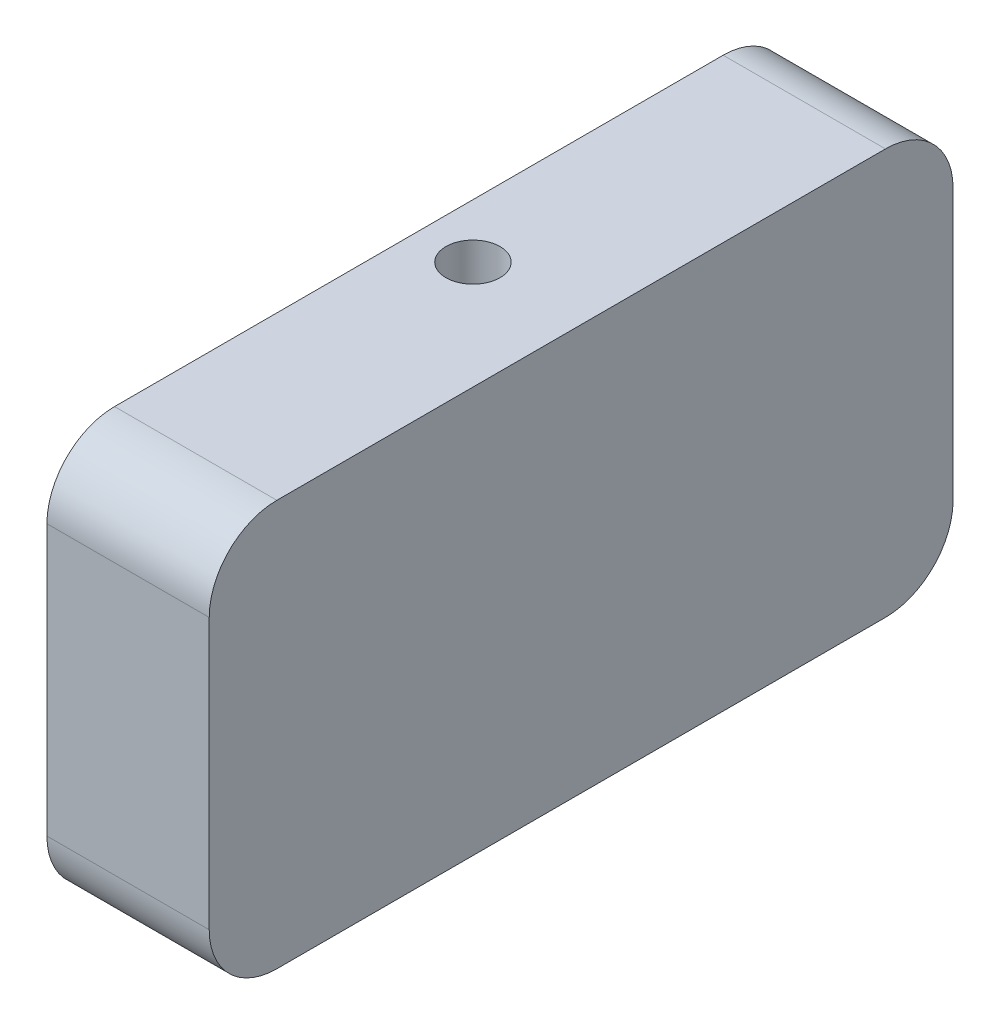
ISO-10303-21;
HEADER;
FILE_DESCRIPTION(('STEP AP214'),'2;1');
FILE_NAME('part.step','',(''),(''),'','','');
FILE_SCHEMA(('AUTOMOTIVE_DESIGN { 1 0 10303 214 1 1 1 1 }'));
ENDSEC;
DATA;
#1=APPLICATION_CONTEXT('core data for automotive mechanical design processes');
#2=APPLICATION_PROTOCOL_DEFINITION('international standard','automotive_design',2000,#1);
#3=PRODUCT_CONTEXT('',#1,'mechanical');
#4=PRODUCT('Part','Part','',(#3));
#5=PRODUCT_RELATED_PRODUCT_CATEGORY('part','',(#4));
#6=PRODUCT_DEFINITION_FORMATION('','',#4);
#7=PRODUCT_DEFINITION_CONTEXT('part definition',#1,'design');
#8=PRODUCT_DEFINITION('design','',#6,#7);
#9=PRODUCT_DEFINITION_SHAPE('','',#8);
#10=(LENGTH_UNIT() NAMED_UNIT(*) SI_UNIT(.MILLI.,.METRE.));
#11=(NAMED_UNIT(*) PLANE_ANGLE_UNIT() SI_UNIT($,.RADIAN.));
#12=(NAMED_UNIT(*) SI_UNIT($,.STERADIAN.) SOLID_ANGLE_UNIT());
#13=UNCERTAINTY_MEASURE_WITH_UNIT(LENGTH_MEASURE(1.E-05),#10,'distance_accuracy_value','');
#14=(GEOMETRIC_REPRESENTATION_CONTEXT(3) GLOBAL_UNCERTAINTY_ASSIGNED_CONTEXT((#13)) GLOBAL_UNIT_ASSIGNED_CONTEXT((#10,
#11,#12)) REPRESENTATION_CONTEXT('',''));
#15=CARTESIAN_POINT('',(0.,0.,0.));
#16=DIRECTION('',(0.,0.,1.));
#17=DIRECTION('',(1.,0.,0.));
#18=AXIS2_PLACEMENT_3D('',#15,#16,#17);
#19=CARTESIAN_POINT('',(12.,10.,-22.5));
#20=DIRECTION('',(-1.,0.,0.));
#21=DIRECTION('',(0.,0.,1.));
#22=AXIS2_PLACEMENT_3D('',#19,#20,#21);
#23=CYLINDRICAL_SURFACE('',#22,5.);
#24=CARTESIAN_POINT('',(0.,10.,-22.5));
#25=DIRECTION('',(1.,0.,0.));
#26=DIRECTION('',(0.,0.,1.));
#27=AXIS2_PLACEMENT_3D('',#24,#25,#26);
#28=CIRCLE('',#27,5.);
#29=CARTESIAN_POINT('',(0.,9.99999999999996,-27.5));
#30=VERTEX_POINT('',#29);
#31=CARTESIAN_POINT('',(0.,15.,-22.5));
#32=VERTEX_POINT('',#31);
#33=EDGE_CURVE('E138',#30,#32,#28,.T.);
#34=ORIENTED_EDGE('',*,*,#33,.T.);
#35=DIRECTION('',(-1.,0.,0.));
#36=VECTOR('',#35,1.);
#37=CARTESIAN_POINT('',(12.,15.,-22.5));
#38=LINE('',#37,#36);
#39=CARTESIAN_POINT('',(12.,15.,-22.5));
#40=VERTEX_POINT('',#39);
#41=EDGE_CURVE('E11',#40,#32,#38,.T.);
#42=ORIENTED_EDGE('',*,*,#41,.F.);
#43=CARTESIAN_POINT('',(12.,10.,-22.5));
#44=DIRECTION('',(1.,0.,0.));
#45=DIRECTION('',(0.,0.,1.));
#46=AXIS2_PLACEMENT_3D('',#43,#44,#45);
#47=CIRCLE('',#46,5.);
#48=CARTESIAN_POINT('',(12.,9.99999999999996,-27.5));
#49=VERTEX_POINT('',#48);
#50=EDGE_CURVE('E153',#49,#40,#47,.T.);
#51=ORIENTED_EDGE('',*,*,#50,.F.);
#52=DIRECTION('',(-1.,0.,0.));
#53=VECTOR('',#52,1.);
#54=CARTESIAN_POINT('',(12.,9.99999999999996,-27.5));
#55=LINE('',#54,#53);
#56=EDGE_CURVE('E134',#49,#30,#55,.T.);
#57=ORIENTED_EDGE('',*,*,#56,.T.);
#58=EDGE_LOOP('',(#34,#42,#51,#57));
#59=FACE_BOUND('',#58,.T.);
#60=ADVANCED_FACE('F36',(#59),#23,.T.);
#61=CARTESIAN_POINT('',(12.,15.,22.5));
#62=DIRECTION('',(0.,-1.,0.));
#63=DIRECTION('',(0.,0.,-1.));
#64=AXIS2_PLACEMENT_3D('',#61,#62,#63);
#65=PLANE('',#64);
#66=CARTESIAN_POINT('',(4.,15.,0.));
#67=DIRECTION('',(0.,-1.,0.));
#68=DIRECTION('',(0.,0.,-1.));
#69=AXIS2_PLACEMENT_3D('',#66,#67,#68);
#70=CIRCLE('',#69,2.);
#71=CARTESIAN_POINT('',(4.,15.,-2.));
#72=VERTEX_POINT('',#71);
#73=EDGE_CURVE('E218',#72,#72,#70,.T.);
#74=ORIENTED_EDGE('',*,*,#73,.T.);
#75=EDGE_LOOP('',(#74));
#76=FACE_BOUND('',#75,.T.);
#77=DIRECTION('',(0.,0.,1.));
#78=VECTOR('',#77,1.);
#79=CARTESIAN_POINT('',(0.,15.,22.5));
#80=LINE('',#79,#78);
#81=CARTESIAN_POINT('',(0.,15.,22.5));
#82=VERTEX_POINT('',#81);
#83=EDGE_CURVE('E141',#32,#82,#80,.T.);
#84=ORIENTED_EDGE('',*,*,#83,.T.);
#85=DIRECTION('',(-1.,0.,0.));
#86=VECTOR('',#85,1.);
#87=CARTESIAN_POINT('',(12.,15.,22.5));
#88=LINE('',#87,#86);
#89=CARTESIAN_POINT('',(12.,15.,22.5));
#90=VERTEX_POINT('',#89);
#91=EDGE_CURVE('E49',#90,#82,#88,.T.);
#92=ORIENTED_EDGE('',*,*,#91,.F.);
#93=DIRECTION('',(0.,0.,1.));
#94=VECTOR('',#93,1.);
#95=CARTESIAN_POINT('',(12.,15.,22.5));
#96=LINE('',#95,#94);
#97=EDGE_CURVE('E101',#40,#90,#96,.T.);
#98=ORIENTED_EDGE('',*,*,#97,.F.);
#99=ORIENTED_EDGE('',*,*,#41,.T.);
#100=EDGE_LOOP('',(#84,#92,#98,#99));
#101=FACE_BOUND('',#100,.T.);
#102=ADVANCED_FACE('F191',(#76,#101),#65,.F.);
#103=CARTESIAN_POINT('',(12.,10.,22.5));
#104=DIRECTION('',(-1.,0.,0.));
#105=DIRECTION('',(0.,0.,1.));
#106=AXIS2_PLACEMENT_3D('',#103,#104,#105);
#107=CYLINDRICAL_SURFACE('',#106,5.);
#108=CARTESIAN_POINT('',(0.,10.,22.5));
#109=DIRECTION('',(1.,0.,0.));
#110=DIRECTION('',(0.,0.,1.));
#111=AXIS2_PLACEMENT_3D('',#108,#109,#110);
#112=CIRCLE('',#111,5.);
#113=CARTESIAN_POINT('',(0.,9.99999999999996,27.5));
#114=VERTEX_POINT('',#113);
#115=EDGE_CURVE('E144',#82,#114,#112,.T.);
#116=ORIENTED_EDGE('',*,*,#115,.T.);
#117=DIRECTION('',(-1.,0.,0.));
#118=VECTOR('',#117,1.);
#119=CARTESIAN_POINT('',(12.,9.99999999999996,27.5));
#120=LINE('',#119,#118);
#121=CARTESIAN_POINT('',(12.,9.99999999999996,27.5));
#122=VERTEX_POINT('',#121);
#123=EDGE_CURVE('E160',#122,#114,#120,.T.);
#124=ORIENTED_EDGE('',*,*,#123,.F.);
#125=CARTESIAN_POINT('',(12.,10.,22.5));
#126=DIRECTION('',(1.,0.,0.));
#127=DIRECTION('',(0.,0.,1.));
#128=AXIS2_PLACEMENT_3D('',#125,#126,#127);
#129=CIRCLE('',#128,5.);
#130=EDGE_CURVE('E207',#90,#122,#129,.T.);
#131=ORIENTED_EDGE('',*,*,#130,.F.);
#132=ORIENTED_EDGE('',*,*,#91,.T.);
#133=EDGE_LOOP('',(#116,#124,#131,#132));
#134=FACE_BOUND('',#133,.T.);
#135=ADVANCED_FACE('F196',(#134),#107,.T.);
#136=CARTESIAN_POINT('',(12.,9.99999999999996,27.5));
#137=DIRECTION('',(0.,0.,-1.));
#138=DIRECTION('',(0.,1.,0.));
#139=AXIS2_PLACEMENT_3D('',#136,#137,#138);
#140=PLANE('',#139);
#141=DIRECTION('',(0.,-1.,0.));
#142=VECTOR('',#141,1.);
#143=CARTESIAN_POINT('',(0.,9.99999999999996,27.5));
#144=LINE('',#143,#142);
#145=CARTESIAN_POINT('',(0.,-9.99999999999997,27.5));
#146=VERTEX_POINT('',#145);
#147=EDGE_CURVE('E146',#114,#146,#144,.T.);
#148=ORIENTED_EDGE('',*,*,#147,.T.);
#149=DIRECTION('',(-1.,0.,0.));
#150=VECTOR('',#149,1.);
#151=CARTESIAN_POINT('',(12.,-9.99999999999997,27.5));
#152=LINE('',#151,#150);
#153=CARTESIAN_POINT('',(12.,-9.99999999999997,27.5));
#154=VERTEX_POINT('',#153);
#155=EDGE_CURVE('E157',#154,#146,#152,.T.);
#156=ORIENTED_EDGE('',*,*,#155,.F.);
#157=DIRECTION('',(0.,-1.,0.));
#158=VECTOR('',#157,1.);
#159=CARTESIAN_POINT('',(12.,9.99999999999996,27.5));
#160=LINE('',#159,#158);
#161=EDGE_CURVE('E209',#122,#154,#160,.T.);
#162=ORIENTED_EDGE('',*,*,#161,.F.);
#163=ORIENTED_EDGE('',*,*,#123,.T.);
#164=EDGE_LOOP('',(#148,#156,#162,#163));
#165=FACE_BOUND('',#164,.T.);
#166=ADVANCED_FACE('F235',(#165),#140,.F.);
#167=CARTESIAN_POINT('',(12.,-10.,22.5));
#168=DIRECTION('',(-1.,0.,0.));
#169=DIRECTION('',(0.,0.,1.));
#170=AXIS2_PLACEMENT_3D('',#167,#168,#169);
#171=CYLINDRICAL_SURFACE('',#170,5.);
#172=CARTESIAN_POINT('',(0.,-10.,22.5));
#173=DIRECTION('',(1.,0.,0.));
#174=DIRECTION('',(0.,0.,1.));
#175=AXIS2_PLACEMENT_3D('',#172,#173,#174);
#176=CIRCLE('',#175,5.);
#177=CARTESIAN_POINT('',(0.,-15.,22.5));
#178=VERTEX_POINT('',#177);
#179=EDGE_CURVE('E148',#146,#178,#176,.T.);
#180=ORIENTED_EDGE('',*,*,#179,.T.);
#181=DIRECTION('',(-1.,0.,0.));
#182=VECTOR('',#181,1.);
#183=CARTESIAN_POINT('',(12.,-15.,22.5));
#184=LINE('',#183,#182);
#185=CARTESIAN_POINT('',(12.,-15.,22.5));
#186=VERTEX_POINT('',#185);
#187=EDGE_CURVE('E129',#186,#178,#184,.T.);
#188=ORIENTED_EDGE('',*,*,#187,.F.);
#189=CARTESIAN_POINT('',(12.,-10.,22.5));
#190=DIRECTION('',(1.,0.,0.));
#191=DIRECTION('',(0.,0.,1.));
#192=AXIS2_PLACEMENT_3D('',#189,#190,#191);
#193=CIRCLE('',#192,5.);
#194=EDGE_CURVE('E120',#154,#186,#193,.T.);
#195=ORIENTED_EDGE('',*,*,#194,.F.);
#196=ORIENTED_EDGE('',*,*,#155,.T.);
#197=EDGE_LOOP('',(#180,#188,#195,#196));
#198=FACE_BOUND('',#197,.T.);
#199=ADVANCED_FACE('F227',(#198),#171,.T.);
#200=CARTESIAN_POINT('',(12.,-15.,22.5));
#201=DIRECTION('',(0.,1.,0.));
#202=DIRECTION('',(0.,0.,1.));
#203=AXIS2_PLACEMENT_3D('',#200,#201,#202);
#204=PLANE('',#203);
#205=CARTESIAN_POINT('',(4.,-15.,0.));
#206=DIRECTION('',(0.,-1.,0.));
#207=DIRECTION('',(0.,0.,-1.));
#208=AXIS2_PLACEMENT_3D('',#205,#206,#207);
#209=CIRCLE('',#208,2.);
#210=CARTESIAN_POINT('',(4.,-15.,-2.));
#211=VERTEX_POINT('',#210);
#212=EDGE_CURVE('E168',#211,#211,#209,.T.);
#213=ORIENTED_EDGE('',*,*,#212,.F.);
#214=EDGE_LOOP('',(#213));
#215=FACE_BOUND('',#214,.T.);
#216=DIRECTION('',(0.,0.,-1.));
#217=VECTOR('',#216,1.);
#218=CARTESIAN_POINT('',(0.,-15.,22.5));
#219=LINE('',#218,#217);
#220=CARTESIAN_POINT('',(0.,-15.,-22.5));
#221=VERTEX_POINT('',#220);
#222=EDGE_CURVE('E128',#178,#221,#219,.T.);
#223=ORIENTED_EDGE('',*,*,#222,.T.);
#224=DIRECTION('',(-1.,0.,0.));
#225=VECTOR('',#224,1.);
#226=CARTESIAN_POINT('',(12.,-15.,-22.5));
#227=LINE('',#226,#225);
#228=CARTESIAN_POINT('',(12.,-15.,-22.5));
#229=VERTEX_POINT('',#228);
#230=EDGE_CURVE('E125',#229,#221,#227,.T.);
#231=ORIENTED_EDGE('',*,*,#230,.F.);
#232=DIRECTION('',(0.,0.,-1.));
#233=VECTOR('',#232,1.);
#234=CARTESIAN_POINT('',(12.,-15.,22.5));
#235=LINE('',#234,#233);
#236=EDGE_CURVE('E114',#186,#229,#235,.T.);
#237=ORIENTED_EDGE('',*,*,#236,.F.);
#238=ORIENTED_EDGE('',*,*,#187,.T.);
#239=EDGE_LOOP('',(#223,#231,#237,#238));
#240=FACE_BOUND('',#239,.T.);
#241=ADVANCED_FACE('F126',(#215,#240),#204,.F.);
#242=CARTESIAN_POINT('',(12.,-10.,-22.5));
#243=DIRECTION('',(-1.,0.,0.));
#244=DIRECTION('',(0.,0.,1.));
#245=AXIS2_PLACEMENT_3D('',#242,#243,#244);
#246=CYLINDRICAL_SURFACE('',#245,5.);
#247=CARTESIAN_POINT('',(0.,-10.,-22.5));
#248=DIRECTION('',(1.,0.,0.));
#249=DIRECTION('',(0.,0.,-1.));
#250=AXIS2_PLACEMENT_3D('',#247,#248,#249);
#251=CIRCLE('',#250,5.);
#252=CARTESIAN_POINT('',(0.,-9.99999999999997,-27.5));
#253=VERTEX_POINT('',#252);
#254=EDGE_CURVE('E87',#221,#253,#251,.T.);
#255=ORIENTED_EDGE('',*,*,#254,.T.);
#256=DIRECTION('',(-1.,0.,0.));
#257=VECTOR('',#256,1.);
#258=CARTESIAN_POINT('',(12.,-9.99999999999997,-27.5));
#259=LINE('',#258,#257);
#260=CARTESIAN_POINT('',(12.,-9.99999999999997,-27.5));
#261=VERTEX_POINT('',#260);
#262=EDGE_CURVE('E130',#261,#253,#259,.T.);
#263=ORIENTED_EDGE('',*,*,#262,.F.);
#264=CARTESIAN_POINT('',(12.,-10.,-22.5));
#265=DIRECTION('',(1.,0.,0.));
#266=DIRECTION('',(0.,0.,-1.));
#267=AXIS2_PLACEMENT_3D('',#264,#265,#266);
#268=CIRCLE('',#267,5.);
#269=EDGE_CURVE('E118',#229,#261,#268,.T.);
#270=ORIENTED_EDGE('',*,*,#269,.F.);
#271=ORIENTED_EDGE('',*,*,#230,.T.);
#272=EDGE_LOOP('',(#255,#263,#270,#271));
#273=FACE_BOUND('',#272,.T.);
#274=ADVANCED_FACE('F132',(#273),#246,.T.);
#275=CARTESIAN_POINT('',(12.,9.99999999999996,-27.5));
#276=DIRECTION('',(0.,0.,1.));
#277=DIRECTION('',(0.,-1.,0.));
#278=AXIS2_PLACEMENT_3D('',#275,#276,#277);
#279=PLANE('',#278);
#280=DIRECTION('',(0.,1.,0.));
#281=VECTOR('',#280,1.);
#282=CARTESIAN_POINT('',(0.,9.99999999999996,-27.5));
#283=LINE('',#282,#281);
#284=EDGE_CURVE('E93',#253,#30,#283,.T.);
#285=ORIENTED_EDGE('',*,*,#284,.T.);
#286=ORIENTED_EDGE('',*,*,#56,.F.);
#287=DIRECTION('',(0.,1.,0.));
#288=VECTOR('',#287,1.);
#289=CARTESIAN_POINT('',(12.,9.99999999999996,-27.5));
#290=LINE('',#289,#288);
#291=EDGE_CURVE('E58',#261,#49,#290,.T.);
#292=ORIENTED_EDGE('',*,*,#291,.F.);
#293=ORIENTED_EDGE('',*,*,#262,.T.);
#294=EDGE_LOOP('',(#285,#286,#292,#293));
#295=FACE_BOUND('',#294,.T.);
#296=ADVANCED_FACE('F233',(#295),#279,.F.);
#297=CARTESIAN_POINT('',(12.,10.,-22.5));
#298=DIRECTION('',(-1.,0.,0.));
#299=DIRECTION('',(0.,0.,1.));
#300=AXIS2_PLACEMENT_3D('',#297,#298,#299);
#301=PLANE('',#300);
#302=ORIENTED_EDGE('',*,*,#50,.T.);
#303=ORIENTED_EDGE('',*,*,#97,.T.);
#304=ORIENTED_EDGE('',*,*,#130,.T.);
#305=ORIENTED_EDGE('',*,*,#161,.T.);
#306=ORIENTED_EDGE('',*,*,#194,.T.);
#307=ORIENTED_EDGE('',*,*,#236,.T.);
#308=ORIENTED_EDGE('',*,*,#269,.T.);
#309=ORIENTED_EDGE('',*,*,#291,.T.);
#310=EDGE_LOOP('',(#302,#303,#304,#305,#306,#307,#308,#309));
#311=FACE_BOUND('',#310,.T.);
#312=ADVANCED_FACE('F116',(#311),#301,.F.);
#313=CARTESIAN_POINT('',(0.,10.,-22.5));
#314=DIRECTION('',(-1.,0.,0.));
#315=DIRECTION('',(0.,0.,1.));
#316=AXIS2_PLACEMENT_3D('',#313,#314,#315);
#317=PLANE('',#316);
#318=CARTESIAN_POINT('',(0.,0.,0.));
#319=DIRECTION('',(-1.,0.,0.));
#320=DIRECTION('',(0.,0.,1.));
#321=AXIS2_PLACEMENT_3D('',#318,#319,#320);
#322=CIRCLE('',#321,8.);
#323=CARTESIAN_POINT('',(0.,0.,8.));
#324=VERTEX_POINT('',#323);
#325=EDGE_CURVE('E215',#324,#324,#322,.T.);
#326=ORIENTED_EDGE('',*,*,#325,.F.);
#327=EDGE_LOOP('',(#326));
#328=FACE_BOUND('',#327,.T.);
#329=ORIENTED_EDGE('',*,*,#33,.F.);
#330=ORIENTED_EDGE('',*,*,#284,.F.);
#331=ORIENTED_EDGE('',*,*,#254,.F.);
#332=ORIENTED_EDGE('',*,*,#222,.F.);
#333=ORIENTED_EDGE('',*,*,#179,.F.);
#334=ORIENTED_EDGE('',*,*,#147,.F.);
#335=ORIENTED_EDGE('',*,*,#115,.F.);
#336=ORIENTED_EDGE('',*,*,#83,.F.);
#337=EDGE_LOOP('',(#329,#330,#331,#332,#333,#334,#335,#336));
#338=FACE_BOUND('',#337,.T.);
#339=ADVANCED_FACE('F187',(#328,#338),#317,.T.);
#340=CARTESIAN_POINT('',(8.,0.,0.));
#341=DIRECTION('',(-1.,0.,0.));
#342=DIRECTION('',(0.,0.,1.));
#343=AXIS2_PLACEMENT_3D('',#340,#341,#342);
#344=CYLINDRICAL_SURFACE('',#343,8.);
#345=CARTESIAN_POINT('',(4.,7.74596669241483,-2.));
#346=CARTESIAN_POINT('',(3.88955939925874,7.74596880070288,-1.99999686287446));
#347=CARTESIAN_POINT('',(3.77908408105718,7.74835444811678,-1.99082099639812));
#348=CARTESIAN_POINT('',(3.56130593746119,7.75761489594051,-1.95441850037103));
#349=CARTESIAN_POINT('',(3.45400499642545,7.76449230897304,-1.92718136539368));
#350=CARTESIAN_POINT('',(3.24575716945025,7.7819097967692,-1.85559295970563));
#351=CARTESIAN_POINT('',(3.14480227569143,7.79244514152366,-1.81126378228359));
#352=CARTESIAN_POINT('',(2.95175131796809,7.81598553623007,-1.70681691300911));
#353=CARTESIAN_POINT('',(2.85965563033583,7.82899069102791,-1.64669855084855));
#354=CARTESIAN_POINT('',(2.68491068379023,7.856325730845,-1.51096674184951));
#355=CARTESIAN_POINT('',(2.60248511971996,7.87067678098427,-1.43506951016324));
#356=CARTESIAN_POINT('',(2.45139088451173,7.89890300412235,-1.27054565128053));
#357=CARTESIAN_POINT('',(2.3827234995026,7.91277813253111,-1.18191783534425));
#358=CARTESIAN_POINT('',(2.26017962589498,7.93872332416466,-0.992916160863163));
#359=CARTESIAN_POINT('',(2.20652288947083,7.95076549920474,-0.892395660956096));
#360=CARTESIAN_POINT('',(2.11695228467753,7.97144649540787,-0.683410547434209));
#361=CARTESIAN_POINT('',(2.08103579846759,7.98008581867475,-0.574947108633551));
#362=CARTESIAN_POINT('',(2.02868173233713,7.99283807078544,-0.355487007003328));
#363=CARTESIAN_POINT('',(2.01186428453873,7.99703915075451,-0.244586175639179));
#364=CARTESIAN_POINT('',(1.99699329657956,8.00074875285838,-0.0214630554102146));
#365=CARTESIAN_POINT('',(1.99893698223232,8.00025796877363,0.0907590356304557));
#366=CARTESIAN_POINT('',(2.02125988020012,7.99470475962828,0.310704494344775));
#367=CARTESIAN_POINT('',(2.04122906004308,7.98974401872699,0.418472431202135));
#368=CARTESIAN_POINT('',(2.0983770160388,7.97592669219883,0.629076494827373));
#369=CARTESIAN_POINT('',(2.13555670830193,7.96706989918753,0.731912358740877));
#370=CARTESIAN_POINT('',(2.22640205654965,7.94630007760717,0.930813407003614));
#371=CARTESIAN_POINT('',(2.2802136357294,7.93436015756043,1.02680901953301));
#372=CARTESIAN_POINT('',(2.40268454329301,7.90871923047719,1.20855124468098));
#373=CARTESIAN_POINT('',(2.4713464548485,7.89501791721992,1.29429607017101));
#374=CARTESIAN_POINT('',(2.6237669935859,7.86690971015616,1.45554807016991));
#375=CARTESIAN_POINT('',(2.70788391387822,7.85249375620734,1.5307153581504));
#376=CARTESIAN_POINT('',(2.8876799788322,7.82492034813365,1.66595275192604));
#377=CARTESIAN_POINT('',(2.9833596635928,7.81176295284776,1.72602215209203));
#378=CARTESIAN_POINT('',(3.18423202731917,7.78816397465319,1.8295762580452));
#379=CARTESIAN_POINT('',(3.28946858425056,7.77773586980577,1.87297913394098));
#380=CARTESIAN_POINT('',(3.50606837446116,7.76094912111966,1.94137124127268));
#381=CARTESIAN_POINT('',(3.61743029118651,7.75458960648175,1.96636441310582));
#382=CARTESIAN_POINT('',(3.8399676012185,7.74684284831312,1.99666371093214));
#383=CARTESIAN_POINT('',(3.9510702346637,7.74532871274918,2.0024723791357));
#384=CARTESIAN_POINT('',(4.17265754926253,7.74709874784831,1.99561359241244));
#385=CARTESIAN_POINT('',(4.28314228636099,7.75038247681013,1.98294783827904));
#386=CARTESIAN_POINT('',(4.49849141196377,7.76125665563648,1.93994037115013));
#387=CARTESIAN_POINT('',(4.60341818125667,7.768775761875,1.9098912546254));
#388=CARTESIAN_POINT('',(4.80674516628135,7.7872057461677,1.8332944653365));
#389=CARTESIAN_POINT('',(4.90514460724427,7.79811702598891,1.78674483817004));
#390=CARTESIAN_POINT('',(5.09475302229388,7.8223690967461,1.67741653434925));
#391=CARTESIAN_POINT('',(5.18578307203448,7.83575334885313,1.6143374030685));
#392=CARTESIAN_POINT('',(5.35615069024108,7.86333666457373,1.47412058586891));
#393=CARTESIAN_POINT('',(5.43548633332006,7.87753586182776,1.39698058961088));
#394=CARTESIAN_POINT('',(5.58224883405677,7.90557922425285,1.22852544196945));
#395=CARTESIAN_POINT('',(5.64932805003905,7.91940561649468,1.13690390506318));
#396=CARTESIAN_POINT('',(5.767148693561,7.94477773290987,0.94340536538935));
#397=CARTESIAN_POINT('',(5.81789097328657,7.95632357603169,0.841528897915181));
#398=CARTESIAN_POINT('',(5.90115682762235,7.9757609259065,0.63111640346218));
#399=CARTESIAN_POINT('',(5.93381142750325,7.98367864017925,0.522634762055764));
#400=CARTESIAN_POINT('',(5.98036826768673,7.99508234716634,0.301499520637614));
#401=CARTESIAN_POINT('',(5.99427412699123,7.99856919514738,0.188846730082481));
#402=CARTESIAN_POINT('',(6.00273517915108,8.00068338817612,-0.0341670528866466));
#403=CARTESIAN_POINT('',(5.99780341819082,7.99943957759977,-0.144507653932043));
#404=CARTESIAN_POINT('',(5.9699043454113,7.99251792914887,-0.362734992829502));
#405=CARTESIAN_POINT('',(5.94693756997366,7.98684022314338,-0.470621803561858));
#406=CARTESIAN_POINT('',(5.88389556045828,7.97170865707778,-0.680342071289549));
#407=CARTESIAN_POINT('',(5.84391309337124,7.96227529004785,-0.782204989161727));
#408=CARTESIAN_POINT('',(5.74805884196085,7.94062577827316,-0.977834106083249));
#409=CARTESIAN_POINT('',(5.69218505465903,7.92840928277515,-1.07159928253127));
#410=CARTESIAN_POINT('',(5.56456953200773,7.90214499360574,-1.25080385684661));
#411=CARTESIAN_POINT('',(5.49247971419234,7.88806033883329,-1.33598997659667));
#412=CARTESIAN_POINT('',(5.33515429604531,7.85981298114379,-1.49323004054701));
#413=CARTESIAN_POINT('',(5.24991536777767,7.84565025934604,-1.56528065015318));
#414=CARTESIAN_POINT('',(5.06679717162108,7.81854951691005,-1.69552405294366));
#415=CARTESIAN_POINT('',(4.96871175326949,7.80563927346578,-1.75343323883276));
#416=CARTESIAN_POINT('',(4.76388902025036,7.78287910989656,-1.85185379317094));
#417=CARTESIAN_POINT('',(4.65715806781231,7.77302696466427,-1.8923778195043));
#418=CARTESIAN_POINT('',(4.45884597632968,7.75903817501475,-1.94884505714201));
#419=CARTESIAN_POINT('',(4.36821367122773,7.75417326006998,-1.96798634119376));
#420=CARTESIAN_POINT('',(4.18506226200462,7.7476367716524,-1.99356458514354));
#421=CARTESIAN_POINT('',(4.0925433195112,7.74596492578215,-2.0000026287435));
#422=CARTESIAN_POINT('',(4.,7.74596669241483,-2.));
#423=B_SPLINE_CURVE_WITH_KNOTS('',3,(#345,#346,#347,#348,#349,#350,#351,#352,#353,#354,#355,
#356,#357,#358,#359,#360,#361,#362,#363,#364,#365,#366,#367,#368,#369,#370,#371,#372,#373,#374,
#375,#376,#377,#378,#379,#380,#381,#382,#383,#384,#385,#386,#387,#388,#389,#390,#391,#392,#393,
#394,#395,#396,#397,#398,#399,#400,#401,#402,#403,#404,#405,#406,#407,#408,#409,#410,#411,#412,
#413,#414,#415,#416,#417,#418,#419,#420,#421,#422),.UNSPECIFIED.,.T.,.F.,(4,2,2,2,2,2,2,2,2,2,2,
2,2,2,2,2,2,2,2,2,2,2,2,2,2,2,2,2,2,2,2,2,2,2,2,2,2,2,4),(0.,0.330981953388909,
0.662156593142933,0.992904581732817,1.32366661404383,1.66099163354381,1.99834817183893,
2.34041197118336,2.68242527877674,3.01751000796277,3.35254518932817,3.68014610151158,
4.00776445379829,4.33834299403556,4.66897908375131,5.0085637325753,5.34816424959842,
5.68941145606722,6.03058560103638,6.36274859809374,6.69488101747042,7.02157924007366,
7.34831617137135,7.68146276687326,8.01466415108036,8.35620264772256,8.69772332575643,
9.03673658245544,9.37568439127231,9.70546756901966,10.0352409390159,10.3632390124777,
10.6912784459046,11.0271767726566,11.3631602525241,11.7054118182895,12.0474137709606,
12.3247826174462,12.6021278008238),.UNSPECIFIED.);
#424=CARTESIAN_POINT('',(4.,7.74596669241483,-2.));
#425=VERTEX_POINT('',#424);
#426=EDGE_CURVE('E39',#425,#425,#423,.T.);
#427=ORIENTED_EDGE('',*,*,#426,.T.);
#428=EDGE_LOOP('',(#427));
#429=FACE_BOUND('',#428,.T.);
#430=CARTESIAN_POINT('',(4.,-7.74596669241483,-2.));
#431=CARTESIAN_POINT('',(4.11044060074126,-7.74596880070288,-1.99999686287446));
#432=CARTESIAN_POINT('',(4.22091591894282,-7.74835444811678,-1.99082099639812));
#433=CARTESIAN_POINT('',(4.43869406253881,-7.75761489594051,-1.95441850037103));
#434=CARTESIAN_POINT('',(4.54599500357455,-7.76449230897304,-1.92718136539368));
#435=CARTESIAN_POINT('',(4.75424283054975,-7.7819097967692,-1.85559295970563));
#436=CARTESIAN_POINT('',(4.85519772430857,-7.79244514152366,-1.81126378228359));
#437=CARTESIAN_POINT('',(5.04824868203191,-7.81598553623007,-1.70681691300911));
#438=CARTESIAN_POINT('',(5.14034436966417,-7.82899069102791,-1.64669855084855));
#439=CARTESIAN_POINT('',(5.31508931620977,-7.856325730845,-1.5109667418495));
#440=CARTESIAN_POINT('',(5.39751488028004,-7.87067678098427,-1.43506951016324));
#441=CARTESIAN_POINT('',(5.54860911548827,-7.89890300412235,-1.27054565128053));
#442=CARTESIAN_POINT('',(5.6172765004974,-7.91277813253111,-1.18191783534424));
#443=CARTESIAN_POINT('',(5.73982037410502,-7.93872332416466,-0.992916160863163));
#444=CARTESIAN_POINT('',(5.79347711052917,-7.95076549920474,-0.892395660956095));
#445=CARTESIAN_POINT('',(5.88304771532247,-7.97144649540787,-0.683410547434209));
#446=CARTESIAN_POINT('',(5.91896420153241,-7.98008581867475,-0.574947108633551));
#447=CARTESIAN_POINT('',(5.97131826766287,-7.99283807078544,-0.355487007003328));
#448=CARTESIAN_POINT('',(5.98813571546127,-7.99703915075451,-0.24458617563918));
#449=CARTESIAN_POINT('',(6.00300670342044,-8.00074875285838,-0.0214630554102146));
#450=CARTESIAN_POINT('',(6.00106301776768,-8.00025796877363,0.0907590356304558));
#451=CARTESIAN_POINT('',(5.97874011979989,-7.99470475962828,0.310704494344775));
#452=CARTESIAN_POINT('',(5.95877093995692,-7.98974401872699,0.418472431202135));
#453=CARTESIAN_POINT('',(5.9016229839612,-7.97592669219883,0.629076494827373));
#454=CARTESIAN_POINT('',(5.86444329169807,-7.96706989918753,0.731912358740877));
#455=CARTESIAN_POINT('',(5.77359794345035,-7.94630007760717,0.930813407003614));
#456=CARTESIAN_POINT('',(5.7197863642706,-7.93436015756043,1.02680901953301));
#457=CARTESIAN_POINT('',(5.59731545670699,-7.90871923047719,1.20855124468098));
#458=CARTESIAN_POINT('',(5.5286535451515,-7.89501791721992,1.29429607017101));
#459=CARTESIAN_POINT('',(5.3762330064141,-7.86690971015616,1.45554807016991));
#460=CARTESIAN_POINT('',(5.29211608612178,-7.85249375620734,1.5307153581504));
#461=CARTESIAN_POINT('',(5.1123200211678,-7.82492034813365,1.66595275192604));
#462=CARTESIAN_POINT('',(5.0166403364072,-7.81176295284776,1.72602215209203));
#463=CARTESIAN_POINT('',(4.81576797268083,-7.78816397465319,1.8295762580452));
#464=CARTESIAN_POINT('',(4.71053141574945,-7.77773586980577,1.87297913394098));
#465=CARTESIAN_POINT('',(4.49393162553884,-7.76094912111966,1.94137124127268));
#466=CARTESIAN_POINT('',(4.38256970881349,-7.75458960648175,1.96636441310582));
#467=CARTESIAN_POINT('',(4.1600323987815,-7.74684284831313,1.99666371093214));
#468=CARTESIAN_POINT('',(4.0489297653363,-7.74532871274919,2.0024723791357));
#469=CARTESIAN_POINT('',(3.82734245073747,-7.74709874784831,1.99561359241244));
#470=CARTESIAN_POINT('',(3.71685771363901,-7.75038247681013,1.98294783827904));
#471=CARTESIAN_POINT('',(3.50150858803623,-7.76125665563648,1.93994037115013));
#472=CARTESIAN_POINT('',(3.39658181874332,-7.768775761875,1.9098912546254));
#473=CARTESIAN_POINT('',(3.19325483371865,-7.7872057461677,1.8332944653365));
#474=CARTESIAN_POINT('',(3.09485539275573,-7.79811702598891,1.78674483817004));
#475=CARTESIAN_POINT('',(2.90524697770612,-7.8223690967461,1.67741653434925));
#476=CARTESIAN_POINT('',(2.81421692796552,-7.83575334885313,1.6143374030685));
#477=CARTESIAN_POINT('',(2.64384930975892,-7.86333666457373,1.47412058586891));
#478=CARTESIAN_POINT('',(2.56451366667994,-7.87753586182776,1.39698058961088));
#479=CARTESIAN_POINT('',(2.41775116594323,-7.90557922425285,1.22852544196945));
#480=CARTESIAN_POINT('',(2.35067194996095,-7.91940561649468,1.13690390506319));
#481=CARTESIAN_POINT('',(2.232851306439,-7.94477773290987,0.94340536538935));
#482=CARTESIAN_POINT('',(2.18210902671344,-7.95632357603169,0.841528897915181));
#483=CARTESIAN_POINT('',(2.09884317237765,-7.9757609259065,0.63111640346218));
#484=CARTESIAN_POINT('',(2.06618857249675,-7.98367864017925,0.522634762055764));
#485=CARTESIAN_POINT('',(2.01963173231327,-7.99508234716634,0.301499520637614));
#486=CARTESIAN_POINT('',(2.00572587300877,-7.99856919514738,0.188846730082481));
#487=CARTESIAN_POINT('',(1.99726482084892,-8.00068338817612,-0.0341670528866468));
#488=CARTESIAN_POINT('',(2.00219658180918,-7.99943957759977,-0.144507653932044));
#489=CARTESIAN_POINT('',(2.0300956545887,-7.99251792914887,-0.362734992829502));
#490=CARTESIAN_POINT('',(2.05306243002634,-7.98684022314338,-0.470621803561858));
#491=CARTESIAN_POINT('',(2.11610443954172,-7.97170865707778,-0.680342071289548));
#492=CARTESIAN_POINT('',(2.15608690662876,-7.96227529004785,-0.782204989161726));
#493=CARTESIAN_POINT('',(2.25194115803914,-7.94062577827316,-0.977834106083248));
#494=CARTESIAN_POINT('',(2.30781494534097,-7.92840928277515,-1.07159928253127));
#495=CARTESIAN_POINT('',(2.43543046799227,-7.90214499360574,-1.25080385684661));
#496=CARTESIAN_POINT('',(2.50752028580766,-7.88806033883329,-1.33598997659667));
#497=CARTESIAN_POINT('',(2.66484570395469,-7.85981298114379,-1.49323004054701));
#498=CARTESIAN_POINT('',(2.75008463222233,-7.84565025934604,-1.56528065015318));
#499=CARTESIAN_POINT('',(2.93320282837892,-7.81854951691005,-1.69552405294366));
#500=CARTESIAN_POINT('',(3.03128824673051,-7.80563927346578,-1.75343323883276));
#501=CARTESIAN_POINT('',(3.23611097974964,-7.78287910989656,-1.85185379317094));
#502=CARTESIAN_POINT('',(3.34284193218769,-7.77302696466428,-1.8923778195043));
#503=CARTESIAN_POINT('',(3.54115402367032,-7.75903817501475,-1.94884505714201));
#504=CARTESIAN_POINT('',(3.63178632877227,-7.75417326006998,-1.96798634119376));
#505=CARTESIAN_POINT('',(3.81493773799538,-7.7476367716524,-1.99356458514354));
#506=CARTESIAN_POINT('',(3.9074566804888,-7.74596492578215,-2.0000026287435));
#507=CARTESIAN_POINT('',(4.,-7.74596669241483,-2.));
#508=B_SPLINE_CURVE_WITH_KNOTS('',3,(#430,#431,#432,#433,#434,#435,#436,#437,#438,#439,#440,
#441,#442,#443,#444,#445,#446,#447,#448,#449,#450,#451,#452,#453,#454,#455,#456,#457,#458,#459,
#460,#461,#462,#463,#464,#465,#466,#467,#468,#469,#470,#471,#472,#473,#474,#475,#476,#477,#478,
#479,#480,#481,#482,#483,#484,#485,#486,#487,#488,#489,#490,#491,#492,#493,#494,#495,#496,#497,
#498,#499,#500,#501,#502,#503,#504,#505,#506,#507),.UNSPECIFIED.,.T.,.F.,(4,2,2,2,2,2,2,2,2,2,2,
2,2,2,2,2,2,2,2,2,2,2,2,2,2,2,2,2,2,2,2,2,2,2,2,2,2,2,4),(0.,0.330981953388909,
0.662156593142934,0.992904581732817,1.32366661404383,1.66099163354381,1.99834817183893,
2.34041197118336,2.68242527877674,3.01751000796277,3.35254518932816,3.68014610151158,
4.00776445379829,4.33834299403556,4.66897908375131,5.00856373257529,5.34816424959842,
5.68941145606722,6.03058560103638,6.36274859809374,6.69488101747042,7.02157924007366,
7.34831617137134,7.68146276687326,8.01466415108036,8.35620264772255,8.69772332575643,
9.03673658245543,9.37568439127231,9.70546756901965,10.0352409390158,10.3632390124777,
10.6912784459046,11.0271767726566,11.3631602525241,11.7054118182895,12.0474137709606,
12.3247826174462,12.6021278008238),.UNSPECIFIED.);
#509=CARTESIAN_POINT('',(4.,-7.74596669241483,-2.));
#510=VERTEX_POINT('',#509);
#511=EDGE_CURVE('E164',#510,#510,#508,.T.);
#512=ORIENTED_EDGE('',*,*,#511,.T.);
#513=EDGE_LOOP('',(#512));
#514=FACE_BOUND('',#513,.T.);
#515=CARTESIAN_POINT('',(8.,0.,0.));
#516=DIRECTION('',(-1.,0.,0.));
#517=DIRECTION('',(0.,0.,1.));
#518=AXIS2_PLACEMENT_3D('',#515,#516,#517);
#519=CIRCLE('',#518,8.);
#520=CARTESIAN_POINT('',(8.,0.,8.));
#521=VERTEX_POINT('',#520);
#522=EDGE_CURVE('E142',#521,#521,#519,.T.);
#523=ORIENTED_EDGE('',*,*,#522,.F.);
#524=EDGE_LOOP('',(#523));
#525=FACE_BOUND('',#524,.T.);
#526=ORIENTED_EDGE('',*,*,#325,.T.);
#527=EDGE_LOOP('',(#526));
#528=FACE_BOUND('',#527,.T.);
#529=ADVANCED_FACE('F169',(#429,#514,#525,#528),#344,.F.);
#530=CARTESIAN_POINT('',(8.,0.,0.));
#531=DIRECTION('',(-1.,0.,0.));
#532=DIRECTION('',(0.,0.,1.));
#533=AXIS2_PLACEMENT_3D('',#530,#531,#532);
#534=PLANE('',#533);
#535=ORIENTED_EDGE('',*,*,#522,.T.);
#536=EDGE_LOOP('',(#535));
#537=FACE_BOUND('',#536,.T.);
#538=ADVANCED_FACE('F178',(#537),#534,.T.);
#539=CARTESIAN_POINT('',(4.,25.,0.));
#540=DIRECTION('',(0.,-1.,0.));
#541=DIRECTION('',(0.,0.,-1.));
#542=AXIS2_PLACEMENT_3D('',#539,#540,#541);
#543=CYLINDRICAL_SURFACE('',#542,2.);
#544=ORIENTED_EDGE('',*,*,#212,.T.);
#545=EDGE_LOOP('',(#544));
#546=FACE_BOUND('',#545,.T.);
#547=ORIENTED_EDGE('',*,*,#511,.F.);
#548=EDGE_LOOP('',(#547));
#549=FACE_BOUND('',#548,.T.);
#550=ADVANCED_FACE('F176',(#546,#549),#543,.F.);
#551=ORIENTED_EDGE('',*,*,#426,.F.);
#552=EDGE_LOOP('',(#551));
#553=FACE_BOUND('',#552,.T.);
#554=ORIENTED_EDGE('',*,*,#73,.F.);
#555=EDGE_LOOP('',(#554));
#556=FACE_BOUND('',#555,.T.);
#557=ADVANCED_FACE('F173',(#553,#556),#543,.F.);
#558=CLOSED_SHELL('',(#60,#102,#135,#166,#199,#241,#274,#296,#312,#339,#529,#538,#550,#557));
#559=MANIFOLD_SOLID_BREP('B2',#558);
#560=ADVANCED_BREP_SHAPE_REPRESENTATION('',(#18,#559),#14);
#561=SHAPE_DEFINITION_REPRESENTATION(#9,#560);
ENDSEC;
END-ISO-10303-21;
